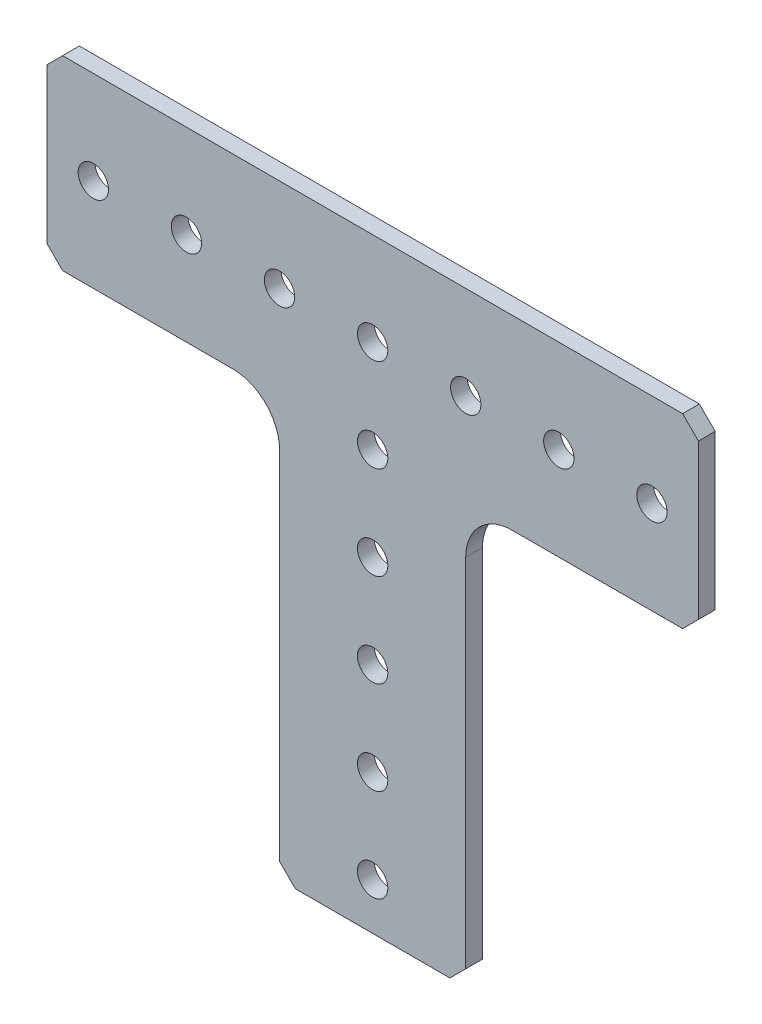
ISO-10303-21;
HEADER;
FILE_DESCRIPTION(('STEP AP214'),'2;1');
FILE_NAME('part.step','',(''),(''),'','','');
FILE_SCHEMA(('AUTOMOTIVE_DESIGN { 1 0 10303 214 1 1 1 1 }'));
ENDSEC;
DATA;
#1=APPLICATION_CONTEXT('core data for automotive mechanical design processes');
#2=APPLICATION_PROTOCOL_DEFINITION('international standard','automotive_design',2000,#1);
#3=PRODUCT_CONTEXT('',#1,'mechanical');
#4=PRODUCT('Part','Part','',(#3));
#5=PRODUCT_RELATED_PRODUCT_CATEGORY('part','',(#4));
#6=PRODUCT_DEFINITION_FORMATION('','',#4);
#7=PRODUCT_DEFINITION_CONTEXT('part definition',#1,'design');
#8=PRODUCT_DEFINITION('design','',#6,#7);
#9=PRODUCT_DEFINITION_SHAPE('','',#8);
#10=(LENGTH_UNIT() NAMED_UNIT(*) SI_UNIT(.MILLI.,.METRE.));
#11=(NAMED_UNIT(*) PLANE_ANGLE_UNIT() SI_UNIT($,.RADIAN.));
#12=(NAMED_UNIT(*) SI_UNIT($,.STERADIAN.) SOLID_ANGLE_UNIT());
#13=UNCERTAINTY_MEASURE_WITH_UNIT(LENGTH_MEASURE(1.E-05),#10,'distance_accuracy_value','');
#14=(GEOMETRIC_REPRESENTATION_CONTEXT(3) GLOBAL_UNCERTAINTY_ASSIGNED_CONTEXT((#13)) GLOBAL_UNIT_ASSIGNED_CONTEXT((#10,
#11,#12)) REPRESENTATION_CONTEXT('',''));
#15=CARTESIAN_POINT('',(0.,0.,0.));
#16=DIRECTION('',(0.,0.,1.));
#17=DIRECTION('',(1.,0.,0.));
#18=AXIS2_PLACEMENT_3D('',#15,#16,#17);
#19=CARTESIAN_POINT('',(10.541,-57.15,0.));
#20=DIRECTION('',(0.707106781186548,-0.707106781186547,0.));
#21=DIRECTION('',(0.707106781186547,0.707106781186548,0.));
#22=AXIS2_PLACEMENT_3D('',#19,#20,#21);
#23=PLANE('',#22);
#24=DIRECTION('',(0.707106781186547,0.707106781186548,0.));
#25=VECTOR('',#24,1.);
#26=CARTESIAN_POINT('',(10.541,-57.15,2.286));
#27=LINE('',#26,#25);
#28=CARTESIAN_POINT('',(10.541,-57.15,2.286));
#29=VERTEX_POINT('',#28);
#30=CARTESIAN_POINT('',(12.7,-54.991,2.286));
#31=VERTEX_POINT('',#30);
#32=EDGE_CURVE('E177',#29,#31,#27,.T.);
#33=ORIENTED_EDGE('',*,*,#32,.F.);
#34=DIRECTION('',(0.,0.,1.));
#35=VECTOR('',#34,1.);
#36=CARTESIAN_POINT('',(10.541,-57.15,0.));
#37=LINE('',#36,#35);
#38=CARTESIAN_POINT('',(10.541,-57.15,0.));
#39=VERTEX_POINT('',#38);
#40=EDGE_CURVE('E11',#39,#29,#37,.T.);
#41=ORIENTED_EDGE('',*,*,#40,.F.);
#42=DIRECTION('',(0.707106781186547,0.707106781186548,0.));
#43=VECTOR('',#42,1.);
#44=CARTESIAN_POINT('',(10.541,-57.15,0.));
#45=LINE('',#44,#43);
#46=CARTESIAN_POINT('',(12.7,-54.991,0.));
#47=VERTEX_POINT('',#46);
#48=EDGE_CURVE('E222',#39,#47,#45,.T.);
#49=ORIENTED_EDGE('',*,*,#48,.T.);
#50=DIRECTION('',(0.,0.,1.));
#51=VECTOR('',#50,1.);
#52=CARTESIAN_POINT('',(12.7,-54.991,0.));
#53=LINE('',#52,#51);
#54=EDGE_CURVE('E35',#47,#31,#53,.T.);
#55=ORIENTED_EDGE('',*,*,#54,.T.);
#56=EDGE_LOOP('',(#33,#41,#49,#55));
#57=FACE_BOUND('',#56,.T.);
#58=ADVANCED_FACE('F32',(#57),#23,.T.);
#59=CARTESIAN_POINT('',(-10.541,-57.15,0.));
#60=DIRECTION('',(0.,-1.,0.));
#61=DIRECTION('',(0.,0.,-1.));
#62=AXIS2_PLACEMENT_3D('',#59,#60,#61);
#63=PLANE('',#62);
#64=DIRECTION('',(1.,0.,0.));
#65=VECTOR('',#64,1.);
#66=CARTESIAN_POINT('',(-10.541,-57.15,2.286));
#67=LINE('',#66,#65);
#68=CARTESIAN_POINT('',(-10.541,-57.15,2.286));
#69=VERTEX_POINT('',#68);
#70=EDGE_CURVE('E220',#69,#29,#67,.T.);
#71=ORIENTED_EDGE('',*,*,#70,.F.);
#72=DIRECTION('',(0.,0.,1.));
#73=VECTOR('',#72,1.);
#74=CARTESIAN_POINT('',(-10.541,-57.15,0.));
#75=LINE('',#74,#73);
#76=CARTESIAN_POINT('',(-10.541,-57.15,0.));
#77=VERTEX_POINT('',#76);
#78=EDGE_CURVE('E41',#77,#69,#75,.T.);
#79=ORIENTED_EDGE('',*,*,#78,.F.);
#80=DIRECTION('',(1.,0.,0.));
#81=VECTOR('',#80,1.);
#82=CARTESIAN_POINT('',(-10.541,-57.15,0.));
#83=LINE('',#82,#81);
#84=EDGE_CURVE('E167',#77,#39,#83,.T.);
#85=ORIENTED_EDGE('',*,*,#84,.T.);
#86=ORIENTED_EDGE('',*,*,#40,.T.);
#87=EDGE_LOOP('',(#71,#79,#85,#86));
#88=FACE_BOUND('',#87,.T.);
#89=ADVANCED_FACE('F250',(#88),#63,.T.);
#90=CARTESIAN_POINT('',(-12.7,-54.991,0.));
#91=DIRECTION('',(-0.707106781186545,-0.70710678118655,0.));
#92=DIRECTION('',(0.70710678118655,-0.707106781186545,0.));
#93=AXIS2_PLACEMENT_3D('',#90,#91,#92);
#94=PLANE('',#93);
#95=DIRECTION('',(0.70710678118655,-0.707106781186545,0.));
#96=VECTOR('',#95,1.);
#97=CARTESIAN_POINT('',(-12.7,-54.991,2.286));
#98=LINE('',#97,#96);
#99=CARTESIAN_POINT('',(-12.7,-54.991,2.286));
#100=VERTEX_POINT('',#99);
#101=EDGE_CURVE('E154',#100,#69,#98,.T.);
#102=ORIENTED_EDGE('',*,*,#101,.F.);
#103=DIRECTION('',(0.,0.,1.));
#104=VECTOR('',#103,1.);
#105=CARTESIAN_POINT('',(-12.7,-54.991,0.));
#106=LINE('',#105,#104);
#107=CARTESIAN_POINT('',(-12.7,-54.991,0.));
#108=VERTEX_POINT('',#107);
#109=EDGE_CURVE('E149',#108,#100,#106,.T.);
#110=ORIENTED_EDGE('',*,*,#109,.F.);
#111=DIRECTION('',(0.70710678118655,-0.707106781186545,0.));
#112=VECTOR('',#111,1.);
#113=CARTESIAN_POINT('',(-12.7,-54.991,0.));
#114=LINE('',#113,#112);
#115=EDGE_CURVE('E152',#108,#77,#114,.T.);
#116=ORIENTED_EDGE('',*,*,#115,.T.);
#117=ORIENTED_EDGE('',*,*,#78,.T.);
#118=EDGE_LOOP('',(#102,#110,#116,#117));
#119=FACE_BOUND('',#118,.T.);
#120=ADVANCED_FACE('F151',(#119),#94,.T.);
#121=CARTESIAN_POINT('',(-12.7,-6.34999999999998,0.));
#122=DIRECTION('',(-1.,0.,0.));
#123=DIRECTION('',(0.,-1.,0.));
#124=AXIS2_PLACEMENT_3D('',#121,#122,#123);
#125=PLANE('',#124);
#126=DIRECTION('',(0.,-1.,0.));
#127=VECTOR('',#126,1.);
#128=CARTESIAN_POINT('',(-12.7,-6.34999999999998,2.286));
#129=LINE('',#128,#127);
#130=CARTESIAN_POINT('',(-12.7,-6.34999999999999,2.286));
#131=VERTEX_POINT('',#130);
#132=EDGE_CURVE('E217',#131,#100,#129,.T.);
#133=ORIENTED_EDGE('',*,*,#132,.F.);
#134=DIRECTION('',(0.,0.,1.));
#135=VECTOR('',#134,1.);
#136=CARTESIAN_POINT('',(-12.7,-6.34999999999999,0.));
#137=LINE('',#136,#135);
#138=CARTESIAN_POINT('',(-12.7,-6.34999999999999,0.));
#139=VERTEX_POINT('',#138);
#140=EDGE_CURVE('E159',#139,#131,#137,.T.);
#141=ORIENTED_EDGE('',*,*,#140,.F.);
#142=DIRECTION('',(0.,-1.,0.));
#143=VECTOR('',#142,1.);
#144=CARTESIAN_POINT('',(-12.7,-6.34999999999998,0.));
#145=LINE('',#144,#143);
#146=EDGE_CURVE('E165',#139,#108,#145,.T.);
#147=ORIENTED_EDGE('',*,*,#146,.T.);
#148=ORIENTED_EDGE('',*,*,#109,.T.);
#149=EDGE_LOOP('',(#133,#141,#147,#148));
#150=FACE_BOUND('',#149,.T.);
#151=ADVANCED_FACE('F169',(#150),#125,.T.);
#152=CARTESIAN_POINT('',(-19.05,-6.34999999999999,0.));
#153=DIRECTION('',(0.,0.,1.));
#154=DIRECTION('',(1.,0.,0.));
#155=AXIS2_PLACEMENT_3D('',#152,#153,#154);
#156=CYLINDRICAL_SURFACE('',#155,6.35);
#157=CARTESIAN_POINT('',(-19.05,-6.34999999999999,2.286));
#158=DIRECTION('',(0.,0.,-1.));
#159=DIRECTION('',(-1.,0.,0.));
#160=AXIS2_PLACEMENT_3D('',#157,#158,#159);
#161=CIRCLE('',#160,6.35);
#162=CARTESIAN_POINT('',(-19.05,0.,2.286));
#163=VERTEX_POINT('',#162);
#164=EDGE_CURVE('E214',#163,#131,#161,.T.);
#165=ORIENTED_EDGE('',*,*,#164,.F.);
#166=DIRECTION('',(0.,0.,1.));
#167=VECTOR('',#166,1.);
#168=CARTESIAN_POINT('',(-19.05,0.,0.));
#169=LINE('',#168,#167);
#170=CARTESIAN_POINT('',(-19.05,0.,0.));
#171=VERTEX_POINT('',#170);
#172=EDGE_CURVE('E226',#171,#163,#169,.T.);
#173=ORIENTED_EDGE('',*,*,#172,.F.);
#174=CARTESIAN_POINT('',(-19.05,-6.34999999999999,0.));
#175=DIRECTION('',(0.,0.,-1.));
#176=DIRECTION('',(-1.,0.,0.));
#177=AXIS2_PLACEMENT_3D('',#174,#175,#176);
#178=CIRCLE('',#177,6.35);
#179=EDGE_CURVE('E170',#171,#139,#178,.T.);
#180=ORIENTED_EDGE('',*,*,#179,.T.);
#181=ORIENTED_EDGE('',*,*,#140,.T.);
#182=EDGE_LOOP('',(#165,#173,#180,#181));
#183=FACE_BOUND('',#182,.T.);
#184=ADVANCED_FACE('F263',(#183),#156,.F.);
#185=CARTESIAN_POINT('',(-42.291,0.,0.));
#186=DIRECTION('',(0.,-1.,0.));
#187=DIRECTION('',(1.,0.,0.));
#188=AXIS2_PLACEMENT_3D('',#185,#186,#187);
#189=PLANE('',#188);
#190=DIRECTION('',(1.,0.,0.));
#191=VECTOR('',#190,1.);
#192=CARTESIAN_POINT('',(-42.291,0.,2.286));
#193=LINE('',#192,#191);
#194=CARTESIAN_POINT('',(-42.291,0.,2.286));
#195=VERTEX_POINT('',#194);
#196=EDGE_CURVE('E211',#195,#163,#193,.T.);
#197=ORIENTED_EDGE('',*,*,#196,.F.);
#198=DIRECTION('',(0.,0.,1.));
#199=VECTOR('',#198,1.);
#200=CARTESIAN_POINT('',(-42.291,0.,0.));
#201=LINE('',#200,#199);
#202=CARTESIAN_POINT('',(-42.291,0.,0.));
#203=VERTEX_POINT('',#202);
#204=EDGE_CURVE('E228',#203,#195,#201,.T.);
#205=ORIENTED_EDGE('',*,*,#204,.F.);
#206=DIRECTION('',(1.,0.,0.));
#207=VECTOR('',#206,1.);
#208=CARTESIAN_POINT('',(-42.291,0.,0.));
#209=LINE('',#208,#207);
#210=EDGE_CURVE('E172',#203,#171,#209,.T.);
#211=ORIENTED_EDGE('',*,*,#210,.T.);
#212=ORIENTED_EDGE('',*,*,#172,.T.);
#213=EDGE_LOOP('',(#197,#205,#211,#212));
#214=FACE_BOUND('',#213,.T.);
#215=ADVANCED_FACE('F266',(#214),#189,.T.);
#216=CARTESIAN_POINT('',(-44.45,2.15899999999999,0.));
#217=DIRECTION('',(-0.707106781186545,-0.70710678118655,0.));
#218=DIRECTION('',(0.70710678118655,-0.707106781186545,0.));
#219=AXIS2_PLACEMENT_3D('',#216,#217,#218);
#220=PLANE('',#219);
#221=DIRECTION('',(0.70710678118655,-0.707106781186545,0.));
#222=VECTOR('',#221,1.);
#223=CARTESIAN_POINT('',(-44.45,2.15899999999999,2.286));
#224=LINE('',#223,#222);
#225=CARTESIAN_POINT('',(-44.45,2.15899999999999,2.286));
#226=VERTEX_POINT('',#225);
#227=EDGE_CURVE('E208',#226,#195,#224,.T.);
#228=ORIENTED_EDGE('',*,*,#227,.F.);
#229=DIRECTION('',(0.,0.,1.));
#230=VECTOR('',#229,1.);
#231=CARTESIAN_POINT('',(-44.45,2.15899999999999,0.));
#232=LINE('',#231,#230);
#233=CARTESIAN_POINT('',(-44.45,2.15899999999999,0.));
#234=VERTEX_POINT('',#233);
#235=EDGE_CURVE('E230',#234,#226,#232,.T.);
#236=ORIENTED_EDGE('',*,*,#235,.F.);
#237=DIRECTION('',(0.70710678118655,-0.707106781186545,0.));
#238=VECTOR('',#237,1.);
#239=CARTESIAN_POINT('',(-44.45,2.15899999999999,0.));
#240=LINE('',#239,#238);
#241=EDGE_CURVE('E468',#234,#203,#240,.T.);
#242=ORIENTED_EDGE('',*,*,#241,.T.);
#243=ORIENTED_EDGE('',*,*,#204,.T.);
#244=EDGE_LOOP('',(#228,#236,#242,#243));
#245=FACE_BOUND('',#244,.T.);
#246=ADVANCED_FACE('F270',(#245),#220,.T.);
#247=CARTESIAN_POINT('',(-44.45,23.241,0.));
#248=DIRECTION('',(-1.,0.,0.));
#249=DIRECTION('',(0.,-1.,0.));
#250=AXIS2_PLACEMENT_3D('',#247,#248,#249);
#251=PLANE('',#250);
#252=DIRECTION('',(0.,-1.,0.));
#253=VECTOR('',#252,1.);
#254=CARTESIAN_POINT('',(-44.45,23.241,2.286));
#255=LINE('',#254,#253);
#256=CARTESIAN_POINT('',(-44.45,23.241,2.286));
#257=VERTEX_POINT('',#256);
#258=EDGE_CURVE('E205',#257,#226,#255,.T.);
#259=ORIENTED_EDGE('',*,*,#258,.F.);
#260=DIRECTION('',(0.,0.,1.));
#261=VECTOR('',#260,1.);
#262=CARTESIAN_POINT('',(-44.45,23.241,0.));
#263=LINE('',#262,#261);
#264=CARTESIAN_POINT('',(-44.45,23.241,0.));
#265=VERTEX_POINT('',#264);
#266=EDGE_CURVE('E232',#265,#257,#263,.T.);
#267=ORIENTED_EDGE('',*,*,#266,.F.);
#268=DIRECTION('',(0.,-1.,0.));
#269=VECTOR('',#268,1.);
#270=CARTESIAN_POINT('',(-44.45,23.241,0.));
#271=LINE('',#270,#269);
#272=EDGE_CURVE('E465',#265,#234,#271,.T.);
#273=ORIENTED_EDGE('',*,*,#272,.T.);
#274=ORIENTED_EDGE('',*,*,#235,.T.);
#275=EDGE_LOOP('',(#259,#267,#273,#274));
#276=FACE_BOUND('',#275,.T.);
#277=ADVANCED_FACE('F274',(#276),#251,.T.);
#278=CARTESIAN_POINT('',(-42.291,25.4,0.));
#279=DIRECTION('',(-0.707106781186543,0.707106781186552,0.));
#280=DIRECTION('',(-0.707106781186552,-0.707106781186543,0.));
#281=AXIS2_PLACEMENT_3D('',#278,#279,#280);
#282=PLANE('',#281);
#283=DIRECTION('',(-0.707106781186552,-0.707106781186543,0.));
#284=VECTOR('',#283,1.);
#285=CARTESIAN_POINT('',(-42.291,25.4,2.286));
#286=LINE('',#285,#284);
#287=CARTESIAN_POINT('',(-42.291,25.4,2.286));
#288=VERTEX_POINT('',#287);
#289=EDGE_CURVE('E202',#288,#257,#286,.T.);
#290=ORIENTED_EDGE('',*,*,#289,.F.);
#291=DIRECTION('',(0.,0.,1.));
#292=VECTOR('',#291,1.);
#293=CARTESIAN_POINT('',(-42.291,25.4,0.));
#294=LINE('',#293,#292);
#295=CARTESIAN_POINT('',(-42.291,25.4,0.));
#296=VERTEX_POINT('',#295);
#297=EDGE_CURVE('E234',#296,#288,#294,.T.);
#298=ORIENTED_EDGE('',*,*,#297,.F.);
#299=DIRECTION('',(-0.707106781186552,-0.707106781186543,0.));
#300=VECTOR('',#299,1.);
#301=CARTESIAN_POINT('',(-42.291,25.4,0.));
#302=LINE('',#301,#300);
#303=EDGE_CURVE('E462',#296,#265,#302,.T.);
#304=ORIENTED_EDGE('',*,*,#303,.T.);
#305=ORIENTED_EDGE('',*,*,#266,.T.);
#306=EDGE_LOOP('',(#290,#298,#304,#305));
#307=FACE_BOUND('',#306,.T.);
#308=ADVANCED_FACE('F278',(#307),#282,.T.);
#309=CARTESIAN_POINT('',(42.291,25.4,0.));
#310=DIRECTION('',(0.,1.,0.));
#311=DIRECTION('',(-1.,0.,0.));
#312=AXIS2_PLACEMENT_3D('',#309,#310,#311);
#313=PLANE('',#312);
#314=DIRECTION('',(-1.,0.,0.));
#315=VECTOR('',#314,1.);
#316=CARTESIAN_POINT('',(42.291,25.4,2.286));
#317=LINE('',#316,#315);
#318=CARTESIAN_POINT('',(42.291,25.4,2.286));
#319=VERTEX_POINT('',#318);
#320=EDGE_CURVE('E199',#319,#288,#317,.T.);
#321=ORIENTED_EDGE('',*,*,#320,.F.);
#322=DIRECTION('',(0.,0.,1.));
#323=VECTOR('',#322,1.);
#324=CARTESIAN_POINT('',(42.291,25.4,0.));
#325=LINE('',#324,#323);
#326=CARTESIAN_POINT('',(42.291,25.4,0.));
#327=VERTEX_POINT('',#326);
#328=EDGE_CURVE('E236',#327,#319,#325,.T.);
#329=ORIENTED_EDGE('',*,*,#328,.F.);
#330=DIRECTION('',(-1.,0.,0.));
#331=VECTOR('',#330,1.);
#332=CARTESIAN_POINT('',(42.291,25.4,0.));
#333=LINE('',#332,#331);
#334=EDGE_CURVE('E459',#327,#296,#333,.T.);
#335=ORIENTED_EDGE('',*,*,#334,.T.);
#336=ORIENTED_EDGE('',*,*,#297,.T.);
#337=EDGE_LOOP('',(#321,#329,#335,#336));
#338=FACE_BOUND('',#337,.T.);
#339=ADVANCED_FACE('F282',(#338),#313,.T.);
#340=CARTESIAN_POINT('',(44.45,23.241,0.));
#341=DIRECTION('',(0.707106781186546,0.707106781186549,0.));
#342=DIRECTION('',(-0.707106781186549,0.707106781186546,0.));
#343=AXIS2_PLACEMENT_3D('',#340,#341,#342);
#344=PLANE('',#343);
#345=DIRECTION('',(-0.707106781186549,0.707106781186546,0.));
#346=VECTOR('',#345,1.);
#347=CARTESIAN_POINT('',(44.45,23.241,2.286));
#348=LINE('',#347,#346);
#349=CARTESIAN_POINT('',(44.45,23.241,2.286));
#350=VERTEX_POINT('',#349);
#351=EDGE_CURVE('E196',#350,#319,#348,.T.);
#352=ORIENTED_EDGE('',*,*,#351,.F.);
#353=DIRECTION('',(0.,0.,1.));
#354=VECTOR('',#353,1.);
#355=CARTESIAN_POINT('',(44.45,23.241,0.));
#356=LINE('',#355,#354);
#357=CARTESIAN_POINT('',(44.45,23.241,0.));
#358=VERTEX_POINT('',#357);
#359=EDGE_CURVE('E238',#358,#350,#356,.T.);
#360=ORIENTED_EDGE('',*,*,#359,.F.);
#361=DIRECTION('',(-0.707106781186549,0.707106781186546,0.));
#362=VECTOR('',#361,1.);
#363=CARTESIAN_POINT('',(44.45,23.241,0.));
#364=LINE('',#363,#362);
#365=EDGE_CURVE('E456',#358,#327,#364,.T.);
#366=ORIENTED_EDGE('',*,*,#365,.T.);
#367=ORIENTED_EDGE('',*,*,#328,.T.);
#368=EDGE_LOOP('',(#352,#360,#366,#367));
#369=FACE_BOUND('',#368,.T.);
#370=ADVANCED_FACE('F286',(#369),#344,.T.);
#371=CARTESIAN_POINT('',(44.45,2.15900000000002,0.));
#372=DIRECTION('',(1.,0.,0.));
#373=DIRECTION('',(0.,1.,0.));
#374=AXIS2_PLACEMENT_3D('',#371,#372,#373);
#375=PLANE('',#374);
#376=DIRECTION('',(0.,1.,0.));
#377=VECTOR('',#376,1.);
#378=CARTESIAN_POINT('',(44.45,2.15900000000002,2.286));
#379=LINE('',#378,#377);
#380=CARTESIAN_POINT('',(44.45,2.15900000000002,2.286));
#381=VERTEX_POINT('',#380);
#382=EDGE_CURVE('E193',#381,#350,#379,.T.);
#383=ORIENTED_EDGE('',*,*,#382,.F.);
#384=DIRECTION('',(0.,0.,1.));
#385=VECTOR('',#384,1.);
#386=CARTESIAN_POINT('',(44.45,2.15900000000002,0.));
#387=LINE('',#386,#385);
#388=CARTESIAN_POINT('',(44.45,2.15900000000002,0.));
#389=VERTEX_POINT('',#388);
#390=EDGE_CURVE('E240',#389,#381,#387,.T.);
#391=ORIENTED_EDGE('',*,*,#390,.F.);
#392=DIRECTION('',(0.,1.,0.));
#393=VECTOR('',#392,1.);
#394=CARTESIAN_POINT('',(44.45,2.15900000000002,0.));
#395=LINE('',#394,#393);
#396=EDGE_CURVE('E453',#389,#358,#395,.T.);
#397=ORIENTED_EDGE('',*,*,#396,.T.);
#398=ORIENTED_EDGE('',*,*,#359,.T.);
#399=EDGE_LOOP('',(#383,#391,#397,#398));
#400=FACE_BOUND('',#399,.T.);
#401=ADVANCED_FACE('F290',(#400),#375,.T.);
#402=CARTESIAN_POINT('',(42.291,0.,0.));
#403=DIRECTION('',(0.707106781186549,-0.707106781186547,0.));
#404=DIRECTION('',(0.707106781186547,0.707106781186549,0.));
#405=AXIS2_PLACEMENT_3D('',#402,#403,#404);
#406=PLANE('',#405);
#407=DIRECTION('',(0.707106781186546,0.707106781186548,0.));
#408=VECTOR('',#407,1.);
#409=CARTESIAN_POINT('',(42.291,0.,2.286));
#410=LINE('',#409,#408);
#411=CARTESIAN_POINT('',(42.291,0.,2.286));
#412=VERTEX_POINT('',#411);
#413=EDGE_CURVE('E190',#412,#381,#410,.T.);
#414=ORIENTED_EDGE('',*,*,#413,.F.);
#415=DIRECTION('',(0.,0.,1.));
#416=VECTOR('',#415,1.);
#417=CARTESIAN_POINT('',(42.291,0.,0.));
#418=LINE('',#417,#416);
#419=CARTESIAN_POINT('',(42.291,0.,0.));
#420=VERTEX_POINT('',#419);
#421=EDGE_CURVE('E242',#420,#412,#418,.T.);
#422=ORIENTED_EDGE('',*,*,#421,.F.);
#423=DIRECTION('',(0.707106781186546,0.707106781186548,0.));
#424=VECTOR('',#423,1.);
#425=CARTESIAN_POINT('',(42.291,0.,0.));
#426=LINE('',#425,#424);
#427=EDGE_CURVE('E450',#420,#389,#426,.T.);
#428=ORIENTED_EDGE('',*,*,#427,.T.);
#429=ORIENTED_EDGE('',*,*,#390,.T.);
#430=EDGE_LOOP('',(#414,#422,#428,#429));
#431=FACE_BOUND('',#430,.T.);
#432=ADVANCED_FACE('F294',(#431),#406,.T.);
#433=CARTESIAN_POINT('',(19.05,0.,0.));
#434=DIRECTION('',(0.,-1.,0.));
#435=DIRECTION('',(1.,0.,0.));
#436=AXIS2_PLACEMENT_3D('',#433,#434,#435);
#437=PLANE('',#436);
#438=DIRECTION('',(1.,0.,0.));
#439=VECTOR('',#438,1.);
#440=CARTESIAN_POINT('',(19.05,0.,2.286));
#441=LINE('',#440,#439);
#442=CARTESIAN_POINT('',(19.05,0.,2.286));
#443=VERTEX_POINT('',#442);
#444=EDGE_CURVE('E187',#443,#412,#441,.T.);
#445=ORIENTED_EDGE('',*,*,#444,.F.);
#446=DIRECTION('',(0.,0.,1.));
#447=VECTOR('',#446,1.);
#448=CARTESIAN_POINT('',(19.05,0.,0.));
#449=LINE('',#448,#447);
#450=CARTESIAN_POINT('',(19.05,0.,0.));
#451=VERTEX_POINT('',#450);
#452=EDGE_CURVE('E244',#451,#443,#449,.T.);
#453=ORIENTED_EDGE('',*,*,#452,.F.);
#454=DIRECTION('',(1.,0.,0.));
#455=VECTOR('',#454,1.);
#456=CARTESIAN_POINT('',(19.05,0.,0.));
#457=LINE('',#456,#455);
#458=EDGE_CURVE('E447',#451,#420,#457,.T.);
#459=ORIENTED_EDGE('',*,*,#458,.T.);
#460=ORIENTED_EDGE('',*,*,#421,.T.);
#461=EDGE_LOOP('',(#445,#453,#459,#460));
#462=FACE_BOUND('',#461,.T.);
#463=ADVANCED_FACE('F298',(#462),#437,.T.);
#464=CARTESIAN_POINT('',(19.05,-6.34999999999998,0.));
#465=DIRECTION('',(0.,0.,1.));
#466=DIRECTION('',(1.,0.,0.));
#467=AXIS2_PLACEMENT_3D('',#464,#465,#466);
#468=CYLINDRICAL_SURFACE('',#467,6.35);
#469=CARTESIAN_POINT('',(19.05,-6.34999999999998,2.286));
#470=DIRECTION('',(0.,0.,-1.));
#471=DIRECTION('',(-1.,0.,0.));
#472=AXIS2_PLACEMENT_3D('',#469,#470,#471);
#473=CIRCLE('',#472,6.35);
#474=CARTESIAN_POINT('',(12.7,-6.34999999999998,2.286));
#475=VERTEX_POINT('',#474);
#476=EDGE_CURVE('E184',#475,#443,#473,.T.);
#477=ORIENTED_EDGE('',*,*,#476,.F.);
#478=DIRECTION('',(0.,0.,1.));
#479=VECTOR('',#478,1.);
#480=CARTESIAN_POINT('',(12.7,-6.34999999999998,0.));
#481=LINE('',#480,#479);
#482=CARTESIAN_POINT('',(12.7,-6.34999999999998,0.));
#483=VERTEX_POINT('',#482);
#484=EDGE_CURVE('E245',#483,#475,#481,.T.);
#485=ORIENTED_EDGE('',*,*,#484,.F.);
#486=CARTESIAN_POINT('',(19.05,-6.34999999999998,0.));
#487=DIRECTION('',(0.,0.,-1.));
#488=DIRECTION('',(-1.,0.,0.));
#489=AXIS2_PLACEMENT_3D('',#486,#487,#488);
#490=CIRCLE('',#489,6.35);
#491=EDGE_CURVE('E444',#483,#451,#490,.T.);
#492=ORIENTED_EDGE('',*,*,#491,.T.);
#493=ORIENTED_EDGE('',*,*,#452,.T.);
#494=EDGE_LOOP('',(#477,#485,#492,#493));
#495=FACE_BOUND('',#494,.T.);
#496=ADVANCED_FACE('F302',(#495),#468,.F.);
#497=CARTESIAN_POINT('',(12.7,-54.991,0.));
#498=DIRECTION('',(1.,0.,0.));
#499=DIRECTION('',(0.,1.,0.));
#500=AXIS2_PLACEMENT_3D('',#497,#498,#499);
#501=PLANE('',#500);
#502=DIRECTION('',(0.,1.,0.));
#503=VECTOR('',#502,1.);
#504=CARTESIAN_POINT('',(12.7,-54.991,2.286));
#505=LINE('',#504,#503);
#506=EDGE_CURVE('E180',#31,#475,#505,.T.);
#507=ORIENTED_EDGE('',*,*,#506,.F.);
#508=ORIENTED_EDGE('',*,*,#54,.F.);
#509=DIRECTION('',(0.,1.,0.));
#510=VECTOR('',#509,1.);
#511=CARTESIAN_POINT('',(12.7,-54.991,0.));
#512=LINE('',#511,#510);
#513=EDGE_CURVE('E442',#47,#483,#512,.T.);
#514=ORIENTED_EDGE('',*,*,#513,.T.);
#515=ORIENTED_EDGE('',*,*,#484,.T.);
#516=EDGE_LOOP('',(#507,#508,#514,#515));
#517=FACE_BOUND('',#516,.T.);
#518=ADVANCED_FACE('F247',(#517),#501,.T.);
#519=CARTESIAN_POINT('',(19.05,-6.34999999999998,0.));
#520=DIRECTION('',(0.,0.,-1.));
#521=DIRECTION('',(-1.,0.,0.));
#522=AXIS2_PLACEMENT_3D('',#519,#520,#521);
#523=PLANE('',#522);
#524=CARTESIAN_POINT('',(0.,-50.8,0.));
#525=DIRECTION('',(0.,0.,1.));
#526=DIRECTION('',(-1.,0.,0.));
#527=AXIS2_PLACEMENT_3D('',#524,#525,#526);
#528=CIRCLE('',#527,2.0701);
#529=CARTESIAN_POINT('',(-2.07009999999999,-50.8,0.));
#530=VERTEX_POINT('',#529);
#531=EDGE_CURVE('E369',#530,#530,#528,.T.);
#532=ORIENTED_EDGE('',*,*,#531,.T.);
#533=EDGE_LOOP('',(#532));
#534=FACE_BOUND('',#533,.T.);
#535=CARTESIAN_POINT('',(0.,-25.4,0.));
#536=DIRECTION('',(0.,0.,1.));
#537=DIRECTION('',(-1.,0.,0.));
#538=AXIS2_PLACEMENT_3D('',#535,#536,#537);
#539=CIRCLE('',#538,2.0701);
#540=CARTESIAN_POINT('',(-2.0701,-25.4,0.));
#541=VERTEX_POINT('',#540);
#542=EDGE_CURVE('E377',#541,#541,#539,.T.);
#543=ORIENTED_EDGE('',*,*,#542,.T.);
#544=EDGE_LOOP('',(#543));
#545=FACE_BOUND('',#544,.T.);
#546=CARTESIAN_POINT('',(0.,0.,0.));
#547=DIRECTION('',(0.,0.,1.));
#548=DIRECTION('',(-1.,0.,0.));
#549=AXIS2_PLACEMENT_3D('',#546,#547,#548);
#550=CIRCLE('',#549,2.0701);
#551=CARTESIAN_POINT('',(-2.0701,0.,0.));
#552=VERTEX_POINT('',#551);
#553=EDGE_CURVE('E383',#552,#552,#550,.T.);
#554=ORIENTED_EDGE('',*,*,#553,.T.);
#555=EDGE_LOOP('',(#554));
#556=FACE_BOUND('',#555,.T.);
#557=CARTESIAN_POINT('',(25.4,12.7,0.));
#558=DIRECTION('',(0.,0.,1.));
#559=DIRECTION('',(-1.,0.,0.));
#560=AXIS2_PLACEMENT_3D('',#557,#558,#559);
#561=CIRCLE('',#560,2.0701);
#562=CARTESIAN_POINT('',(23.3299,12.7,0.));
#563=VERTEX_POINT('',#562);
#564=EDGE_CURVE('E389',#563,#563,#561,.T.);
#565=ORIENTED_EDGE('',*,*,#564,.T.);
#566=EDGE_LOOP('',(#565));
#567=FACE_BOUND('',#566,.T.);
#568=CARTESIAN_POINT('',(0.,12.7,0.));
#569=DIRECTION('',(0.,0.,1.));
#570=DIRECTION('',(-1.,0.,0.));
#571=AXIS2_PLACEMENT_3D('',#568,#569,#570);
#572=CIRCLE('',#571,2.0701);
#573=CARTESIAN_POINT('',(-2.0701,12.7,0.));
#574=VERTEX_POINT('',#573);
#575=EDGE_CURVE('E395',#574,#574,#572,.T.);
#576=ORIENTED_EDGE('',*,*,#575,.T.);
#577=EDGE_LOOP('',(#576));
#578=FACE_BOUND('',#577,.T.);
#579=CARTESIAN_POINT('',(-25.4,12.7,0.));
#580=DIRECTION('',(0.,0.,1.));
#581=DIRECTION('',(-1.,0.,0.));
#582=AXIS2_PLACEMENT_3D('',#579,#580,#581);
#583=CIRCLE('',#582,2.0701);
#584=CARTESIAN_POINT('',(-27.4701,12.7,0.));
#585=VERTEX_POINT('',#584);
#586=EDGE_CURVE('E401',#585,#585,#583,.T.);
#587=ORIENTED_EDGE('',*,*,#586,.T.);
#588=EDGE_LOOP('',(#587));
#589=FACE_BOUND('',#588,.T.);
#590=CARTESIAN_POINT('',(-38.1,12.7,0.));
#591=DIRECTION('',(0.,0.,1.));
#592=DIRECTION('',(-1.,0.,0.));
#593=AXIS2_PLACEMENT_3D('',#590,#591,#592);
#594=CIRCLE('',#593,2.0701);
#595=CARTESIAN_POINT('',(-40.1701,12.7,0.));
#596=VERTEX_POINT('',#595);
#597=EDGE_CURVE('E407',#596,#596,#594,.T.);
#598=ORIENTED_EDGE('',*,*,#597,.T.);
#599=EDGE_LOOP('',(#598));
#600=FACE_BOUND('',#599,.T.);
#601=CARTESIAN_POINT('',(-12.7,12.7,0.));
#602=DIRECTION('',(0.,0.,1.));
#603=DIRECTION('',(-1.,0.,0.));
#604=AXIS2_PLACEMENT_3D('',#601,#602,#603);
#605=CIRCLE('',#604,2.0701);
#606=CARTESIAN_POINT('',(-14.7701,12.7,0.));
#607=VERTEX_POINT('',#606);
#608=EDGE_CURVE('E413',#607,#607,#605,.T.);
#609=ORIENTED_EDGE('',*,*,#608,.T.);
#610=EDGE_LOOP('',(#609));
#611=FACE_BOUND('',#610,.T.);
#612=CARTESIAN_POINT('',(12.7,12.7,0.));
#613=DIRECTION('',(0.,0.,1.));
#614=DIRECTION('',(-1.,0.,0.));
#615=AXIS2_PLACEMENT_3D('',#612,#613,#614);
#616=CIRCLE('',#615,2.0701);
#617=CARTESIAN_POINT('',(10.6299,12.7,0.));
#618=VERTEX_POINT('',#617);
#619=EDGE_CURVE('E419',#618,#618,#616,.T.);
#620=ORIENTED_EDGE('',*,*,#619,.T.);
#621=EDGE_LOOP('',(#620));
#622=FACE_BOUND('',#621,.T.);
#623=CARTESIAN_POINT('',(38.1,12.7,0.));
#624=DIRECTION('',(0.,0.,1.));
#625=DIRECTION('',(-1.,0.,0.));
#626=AXIS2_PLACEMENT_3D('',#623,#624,#625);
#627=CIRCLE('',#626,2.0701);
#628=CARTESIAN_POINT('',(36.0299,12.7,0.));
#629=VERTEX_POINT('',#628);
#630=EDGE_CURVE('E425',#629,#629,#627,.T.);
#631=ORIENTED_EDGE('',*,*,#630,.T.);
#632=EDGE_LOOP('',(#631));
#633=FACE_BOUND('',#632,.T.);
#634=CARTESIAN_POINT('',(0.,-12.7,0.));
#635=DIRECTION('',(0.,0.,1.));
#636=DIRECTION('',(-1.,0.,0.));
#637=AXIS2_PLACEMENT_3D('',#634,#635,#636);
#638=CIRCLE('',#637,2.0701);
#639=CARTESIAN_POINT('',(-2.0701,-12.7,0.));
#640=VERTEX_POINT('',#639);
#641=EDGE_CURVE('E431',#640,#640,#638,.T.);
#642=ORIENTED_EDGE('',*,*,#641,.T.);
#643=EDGE_LOOP('',(#642));
#644=FACE_BOUND('',#643,.T.);
#645=CARTESIAN_POINT('',(0.,-38.1,0.));
#646=DIRECTION('',(0.,0.,1.));
#647=DIRECTION('',(-1.,0.,0.));
#648=AXIS2_PLACEMENT_3D('',#645,#646,#647);
#649=CIRCLE('',#648,2.0701);
#650=CARTESIAN_POINT('',(-2.0701,-38.1,0.));
#651=VERTEX_POINT('',#650);
#652=EDGE_CURVE('E181',#651,#651,#649,.T.);
#653=ORIENTED_EDGE('',*,*,#652,.T.);
#654=EDGE_LOOP('',(#653));
#655=FACE_BOUND('',#654,.T.);
#656=ORIENTED_EDGE('',*,*,#48,.F.);
#657=ORIENTED_EDGE('',*,*,#84,.F.);
#658=ORIENTED_EDGE('',*,*,#115,.F.);
#659=ORIENTED_EDGE('',*,*,#146,.F.);
#660=ORIENTED_EDGE('',*,*,#179,.F.);
#661=ORIENTED_EDGE('',*,*,#210,.F.);
#662=ORIENTED_EDGE('',*,*,#241,.F.);
#663=ORIENTED_EDGE('',*,*,#272,.F.);
#664=ORIENTED_EDGE('',*,*,#303,.F.);
#665=ORIENTED_EDGE('',*,*,#334,.F.);
#666=ORIENTED_EDGE('',*,*,#365,.F.);
#667=ORIENTED_EDGE('',*,*,#396,.F.);
#668=ORIENTED_EDGE('',*,*,#427,.F.);
#669=ORIENTED_EDGE('',*,*,#458,.F.);
#670=ORIENTED_EDGE('',*,*,#491,.F.);
#671=ORIENTED_EDGE('',*,*,#513,.F.);
#672=EDGE_LOOP('',(#656,#657,#658,#659,#660,#661,#662,#663,#664,#665,#666,#667,#668,#669,#670,#671));
#673=FACE_BOUND('',#672,.T.);
#674=ADVANCED_FACE('F163',(#534,#545,#556,#567,#578,#589,#600,#611,#622,#633,#644,#655,#673),
#523,.T.);
#675=CARTESIAN_POINT('',(19.05,-6.34999999999998,2.286));
#676=DIRECTION('',(0.,0.,-1.));
#677=DIRECTION('',(-1.,0.,0.));
#678=AXIS2_PLACEMENT_3D('',#675,#676,#677);
#679=PLANE('',#678);
#680=CARTESIAN_POINT('',(0.,-50.8,2.286));
#681=DIRECTION('',(0.,0.,1.));
#682=DIRECTION('',(-1.,0.,0.));
#683=AXIS2_PLACEMENT_3D('',#680,#681,#682);
#684=CIRCLE('',#683,2.0701);
#685=CARTESIAN_POINT('',(-2.07009999999999,-50.8,2.286));
#686=VERTEX_POINT('',#685);
#687=EDGE_CURVE('E372',#686,#686,#684,.T.);
#688=ORIENTED_EDGE('',*,*,#687,.F.);
#689=EDGE_LOOP('',(#688));
#690=FACE_BOUND('',#689,.T.);
#691=CARTESIAN_POINT('',(0.,-25.4,2.286));
#692=DIRECTION('',(0.,0.,1.));
#693=DIRECTION('',(-1.,0.,0.));
#694=AXIS2_PLACEMENT_3D('',#691,#692,#693);
#695=CIRCLE('',#694,2.0701);
#696=CARTESIAN_POINT('',(-2.0701,-25.4,2.286));
#697=VERTEX_POINT('',#696);
#698=EDGE_CURVE('E374',#697,#697,#695,.T.);
#699=ORIENTED_EDGE('',*,*,#698,.F.);
#700=EDGE_LOOP('',(#699));
#701=FACE_BOUND('',#700,.T.);
#702=CARTESIAN_POINT('',(0.,0.,2.286));
#703=DIRECTION('',(0.,0.,1.));
#704=DIRECTION('',(-1.,0.,0.));
#705=AXIS2_PLACEMENT_3D('',#702,#703,#704);
#706=CIRCLE('',#705,2.0701);
#707=CARTESIAN_POINT('',(-2.0701,0.,2.286));
#708=VERTEX_POINT('',#707);
#709=EDGE_CURVE('E380',#708,#708,#706,.T.);
#710=ORIENTED_EDGE('',*,*,#709,.F.);
#711=EDGE_LOOP('',(#710));
#712=FACE_BOUND('',#711,.T.);
#713=CARTESIAN_POINT('',(25.4,12.7,2.286));
#714=DIRECTION('',(0.,0.,1.));
#715=DIRECTION('',(-1.,0.,0.));
#716=AXIS2_PLACEMENT_3D('',#713,#714,#715);
#717=CIRCLE('',#716,2.0701);
#718=CARTESIAN_POINT('',(23.3299,12.7,2.286));
#719=VERTEX_POINT('',#718);
#720=EDGE_CURVE('E386',#719,#719,#717,.T.);
#721=ORIENTED_EDGE('',*,*,#720,.F.);
#722=EDGE_LOOP('',(#721));
#723=FACE_BOUND('',#722,.T.);
#724=CARTESIAN_POINT('',(0.,12.7,2.286));
#725=DIRECTION('',(0.,0.,1.));
#726=DIRECTION('',(-1.,0.,0.));
#727=AXIS2_PLACEMENT_3D('',#724,#725,#726);
#728=CIRCLE('',#727,2.0701);
#729=CARTESIAN_POINT('',(-2.0701,12.7,2.286));
#730=VERTEX_POINT('',#729);
#731=EDGE_CURVE('E392',#730,#730,#728,.T.);
#732=ORIENTED_EDGE('',*,*,#731,.F.);
#733=EDGE_LOOP('',(#732));
#734=FACE_BOUND('',#733,.T.);
#735=CARTESIAN_POINT('',(-25.4,12.7,2.286));
#736=DIRECTION('',(0.,0.,1.));
#737=DIRECTION('',(-1.,0.,0.));
#738=AXIS2_PLACEMENT_3D('',#735,#736,#737);
#739=CIRCLE('',#738,2.0701);
#740=CARTESIAN_POINT('',(-27.4701,12.7,2.286));
#741=VERTEX_POINT('',#740);
#742=EDGE_CURVE('E398',#741,#741,#739,.T.);
#743=ORIENTED_EDGE('',*,*,#742,.F.);
#744=EDGE_LOOP('',(#743));
#745=FACE_BOUND('',#744,.T.);
#746=CARTESIAN_POINT('',(-38.1,12.7,2.286));
#747=DIRECTION('',(0.,0.,1.));
#748=DIRECTION('',(-1.,0.,0.));
#749=AXIS2_PLACEMENT_3D('',#746,#747,#748);
#750=CIRCLE('',#749,2.0701);
#751=CARTESIAN_POINT('',(-40.1701,12.7,2.286));
#752=VERTEX_POINT('',#751);
#753=EDGE_CURVE('E404',#752,#752,#750,.T.);
#754=ORIENTED_EDGE('',*,*,#753,.F.);
#755=EDGE_LOOP('',(#754));
#756=FACE_BOUND('',#755,.T.);
#757=CARTESIAN_POINT('',(-12.7,12.7,2.286));
#758=DIRECTION('',(0.,0.,1.));
#759=DIRECTION('',(-1.,0.,0.));
#760=AXIS2_PLACEMENT_3D('',#757,#758,#759);
#761=CIRCLE('',#760,2.0701);
#762=CARTESIAN_POINT('',(-14.7701,12.7,2.286));
#763=VERTEX_POINT('',#762);
#764=EDGE_CURVE('E410',#763,#763,#761,.T.);
#765=ORIENTED_EDGE('',*,*,#764,.F.);
#766=EDGE_LOOP('',(#765));
#767=FACE_BOUND('',#766,.T.);
#768=CARTESIAN_POINT('',(12.7,12.7,2.286));
#769=DIRECTION('',(0.,0.,1.));
#770=DIRECTION('',(-1.,0.,0.));
#771=AXIS2_PLACEMENT_3D('',#768,#769,#770);
#772=CIRCLE('',#771,2.0701);
#773=CARTESIAN_POINT('',(10.6299,12.7,2.286));
#774=VERTEX_POINT('',#773);
#775=EDGE_CURVE('E416',#774,#774,#772,.T.);
#776=ORIENTED_EDGE('',*,*,#775,.F.);
#777=EDGE_LOOP('',(#776));
#778=FACE_BOUND('',#777,.T.);
#779=CARTESIAN_POINT('',(38.1,12.7,2.286));
#780=DIRECTION('',(0.,0.,1.));
#781=DIRECTION('',(-1.,0.,0.));
#782=AXIS2_PLACEMENT_3D('',#779,#780,#781);
#783=CIRCLE('',#782,2.0701);
#784=CARTESIAN_POINT('',(36.0299,12.7,2.286));
#785=VERTEX_POINT('',#784);
#786=EDGE_CURVE('E422',#785,#785,#783,.T.);
#787=ORIENTED_EDGE('',*,*,#786,.F.);
#788=EDGE_LOOP('',(#787));
#789=FACE_BOUND('',#788,.T.);
#790=CARTESIAN_POINT('',(0.,-12.7,2.286));
#791=DIRECTION('',(0.,0.,1.));
#792=DIRECTION('',(-1.,0.,0.));
#793=AXIS2_PLACEMENT_3D('',#790,#791,#792);
#794=CIRCLE('',#793,2.0701);
#795=CARTESIAN_POINT('',(-2.0701,-12.7,2.286));
#796=VERTEX_POINT('',#795);
#797=EDGE_CURVE('E428',#796,#796,#794,.T.);
#798=ORIENTED_EDGE('',*,*,#797,.F.);
#799=EDGE_LOOP('',(#798));
#800=FACE_BOUND('',#799,.T.);
#801=CARTESIAN_POINT('',(0.,-38.1,2.286));
#802=DIRECTION('',(0.,0.,1.));
#803=DIRECTION('',(-1.,0.,0.));
#804=AXIS2_PLACEMENT_3D('',#801,#802,#803);
#805=CIRCLE('',#804,2.0701);
#806=CARTESIAN_POINT('',(-2.0701,-38.1,2.286));
#807=VERTEX_POINT('',#806);
#808=EDGE_CURVE('E434',#807,#807,#805,.T.);
#809=ORIENTED_EDGE('',*,*,#808,.F.);
#810=EDGE_LOOP('',(#809));
#811=FACE_BOUND('',#810,.T.);
#812=ORIENTED_EDGE('',*,*,#32,.T.);
#813=ORIENTED_EDGE('',*,*,#506,.T.);
#814=ORIENTED_EDGE('',*,*,#476,.T.);
#815=ORIENTED_EDGE('',*,*,#444,.T.);
#816=ORIENTED_EDGE('',*,*,#413,.T.);
#817=ORIENTED_EDGE('',*,*,#382,.T.);
#818=ORIENTED_EDGE('',*,*,#351,.T.);
#819=ORIENTED_EDGE('',*,*,#320,.T.);
#820=ORIENTED_EDGE('',*,*,#289,.T.);
#821=ORIENTED_EDGE('',*,*,#258,.T.);
#822=ORIENTED_EDGE('',*,*,#227,.T.);
#823=ORIENTED_EDGE('',*,*,#196,.T.);
#824=ORIENTED_EDGE('',*,*,#164,.T.);
#825=ORIENTED_EDGE('',*,*,#132,.T.);
#826=ORIENTED_EDGE('',*,*,#101,.T.);
#827=ORIENTED_EDGE('',*,*,#70,.T.);
#828=EDGE_LOOP('',(#812,#813,#814,#815,#816,#817,#818,#819,#820,#821,#822,#823,#824,#825,#826,#827));
#829=FACE_BOUND('',#828,.T.);
#830=ADVANCED_FACE('F249',(#690,#701,#712,#723,#734,#745,#756,#767,#778,#789,#800,#811,#829),
#679,.F.);
#831=CARTESIAN_POINT('',(0.,-38.1,0.));
#832=DIRECTION('',(0.,0.,1.));
#833=DIRECTION('',(1.,0.,0.));
#834=AXIS2_PLACEMENT_3D('',#831,#832,#833);
#835=CYLINDRICAL_SURFACE('',#834,2.0701);
#836=ORIENTED_EDGE('',*,*,#652,.F.);
#837=EDGE_LOOP('',(#836));
#838=FACE_BOUND('',#837,.T.);
#839=ORIENTED_EDGE('',*,*,#808,.T.);
#840=EDGE_LOOP('',(#839));
#841=FACE_BOUND('',#840,.T.);
#842=ADVANCED_FACE('F314',(#838,#841),#835,.F.);
#843=CARTESIAN_POINT('',(0.,-12.7,0.));
#844=DIRECTION('',(0.,0.,1.));
#845=DIRECTION('',(1.,0.,0.));
#846=AXIS2_PLACEMENT_3D('',#843,#844,#845);
#847=CYLINDRICAL_SURFACE('',#846,2.0701);
#848=ORIENTED_EDGE('',*,*,#641,.F.);
#849=EDGE_LOOP('',(#848));
#850=FACE_BOUND('',#849,.T.);
#851=ORIENTED_EDGE('',*,*,#797,.T.);
#852=EDGE_LOOP('',(#851));
#853=FACE_BOUND('',#852,.T.);
#854=ADVANCED_FACE('F321',(#850,#853),#847,.F.);
#855=CARTESIAN_POINT('',(38.1,12.7,0.));
#856=DIRECTION('',(0.,0.,1.));
#857=DIRECTION('',(1.,0.,0.));
#858=AXIS2_PLACEMENT_3D('',#855,#856,#857);
#859=CYLINDRICAL_SURFACE('',#858,2.0701);
#860=ORIENTED_EDGE('',*,*,#630,.F.);
#861=EDGE_LOOP('',(#860));
#862=FACE_BOUND('',#861,.T.);
#863=ORIENTED_EDGE('',*,*,#786,.T.);
#864=EDGE_LOOP('',(#863));
#865=FACE_BOUND('',#864,.T.);
#866=ADVANCED_FACE('F325',(#862,#865),#859,.F.);
#867=CARTESIAN_POINT('',(12.7,12.7,0.));
#868=DIRECTION('',(0.,0.,1.));
#869=DIRECTION('',(1.,0.,0.));
#870=AXIS2_PLACEMENT_3D('',#867,#868,#869);
#871=CYLINDRICAL_SURFACE('',#870,2.0701);
#872=ORIENTED_EDGE('',*,*,#619,.F.);
#873=EDGE_LOOP('',(#872));
#874=FACE_BOUND('',#873,.T.);
#875=ORIENTED_EDGE('',*,*,#775,.T.);
#876=EDGE_LOOP('',(#875));
#877=FACE_BOUND('',#876,.T.);
#878=ADVANCED_FACE('F329',(#874,#877),#871,.F.);
#879=CARTESIAN_POINT('',(-12.7,12.7,0.));
#880=DIRECTION('',(0.,0.,1.));
#881=DIRECTION('',(1.,0.,0.));
#882=AXIS2_PLACEMENT_3D('',#879,#880,#881);
#883=CYLINDRICAL_SURFACE('',#882,2.0701);
#884=ORIENTED_EDGE('',*,*,#608,.F.);
#885=EDGE_LOOP('',(#884));
#886=FACE_BOUND('',#885,.T.);
#887=ORIENTED_EDGE('',*,*,#764,.T.);
#888=EDGE_LOOP('',(#887));
#889=FACE_BOUND('',#888,.T.);
#890=ADVANCED_FACE('F333',(#886,#889),#883,.F.);
#891=CARTESIAN_POINT('',(-38.1,12.7,0.));
#892=DIRECTION('',(0.,0.,1.));
#893=DIRECTION('',(1.,0.,0.));
#894=AXIS2_PLACEMENT_3D('',#891,#892,#893);
#895=CYLINDRICAL_SURFACE('',#894,2.0701);
#896=ORIENTED_EDGE('',*,*,#597,.F.);
#897=EDGE_LOOP('',(#896));
#898=FACE_BOUND('',#897,.T.);
#899=ORIENTED_EDGE('',*,*,#753,.T.);
#900=EDGE_LOOP('',(#899));
#901=FACE_BOUND('',#900,.T.);
#902=ADVANCED_FACE('F337',(#898,#901),#895,.F.);
#903=CARTESIAN_POINT('',(-25.4,12.7,0.));
#904=DIRECTION('',(0.,0.,1.));
#905=DIRECTION('',(1.,0.,0.));
#906=AXIS2_PLACEMENT_3D('',#903,#904,#905);
#907=CYLINDRICAL_SURFACE('',#906,2.0701);
#908=ORIENTED_EDGE('',*,*,#586,.F.);
#909=EDGE_LOOP('',(#908));
#910=FACE_BOUND('',#909,.T.);
#911=ORIENTED_EDGE('',*,*,#742,.T.);
#912=EDGE_LOOP('',(#911));
#913=FACE_BOUND('',#912,.T.);
#914=ADVANCED_FACE('F341',(#910,#913),#907,.F.);
#915=CARTESIAN_POINT('',(0.,12.7,0.));
#916=DIRECTION('',(0.,0.,1.));
#917=DIRECTION('',(1.,0.,0.));
#918=AXIS2_PLACEMENT_3D('',#915,#916,#917);
#919=CYLINDRICAL_SURFACE('',#918,2.0701);
#920=ORIENTED_EDGE('',*,*,#575,.F.);
#921=EDGE_LOOP('',(#920));
#922=FACE_BOUND('',#921,.T.);
#923=ORIENTED_EDGE('',*,*,#731,.T.);
#924=EDGE_LOOP('',(#923));
#925=FACE_BOUND('',#924,.T.);
#926=ADVANCED_FACE('F345',(#922,#925),#919,.F.);
#927=CARTESIAN_POINT('',(25.4,12.7,0.));
#928=DIRECTION('',(0.,0.,1.));
#929=DIRECTION('',(1.,0.,0.));
#930=AXIS2_PLACEMENT_3D('',#927,#928,#929);
#931=CYLINDRICAL_SURFACE('',#930,2.0701);
#932=ORIENTED_EDGE('',*,*,#564,.F.);
#933=EDGE_LOOP('',(#932));
#934=FACE_BOUND('',#933,.T.);
#935=ORIENTED_EDGE('',*,*,#720,.T.);
#936=EDGE_LOOP('',(#935));
#937=FACE_BOUND('',#936,.T.);
#938=ADVANCED_FACE('F349',(#934,#937),#931,.F.);
#939=CARTESIAN_POINT('',(0.,0.,0.));
#940=DIRECTION('',(0.,0.,1.));
#941=DIRECTION('',(1.,0.,0.));
#942=AXIS2_PLACEMENT_3D('',#939,#940,#941);
#943=CYLINDRICAL_SURFACE('',#942,2.0701);
#944=ORIENTED_EDGE('',*,*,#553,.F.);
#945=EDGE_LOOP('',(#944));
#946=FACE_BOUND('',#945,.T.);
#947=ORIENTED_EDGE('',*,*,#709,.T.);
#948=EDGE_LOOP('',(#947));
#949=FACE_BOUND('',#948,.T.);
#950=ADVANCED_FACE('F353',(#946,#949),#943,.F.);
#951=CARTESIAN_POINT('',(0.,-25.4,0.));
#952=DIRECTION('',(0.,0.,1.));
#953=DIRECTION('',(1.,0.,0.));
#954=AXIS2_PLACEMENT_3D('',#951,#952,#953);
#955=CYLINDRICAL_SURFACE('',#954,2.0701);
#956=ORIENTED_EDGE('',*,*,#542,.F.);
#957=EDGE_LOOP('',(#956));
#958=FACE_BOUND('',#957,.T.);
#959=ORIENTED_EDGE('',*,*,#698,.T.);
#960=EDGE_LOOP('',(#959));
#961=FACE_BOUND('',#960,.T.);
#962=ADVANCED_FACE('F357',(#958,#961),#955,.F.);
#963=CARTESIAN_POINT('',(0.,-50.8,0.));
#964=DIRECTION('',(0.,0.,1.));
#965=DIRECTION('',(1.,0.,0.));
#966=AXIS2_PLACEMENT_3D('',#963,#964,#965);
#967=CYLINDRICAL_SURFACE('',#966,2.0701);
#968=ORIENTED_EDGE('',*,*,#531,.F.);
#969=EDGE_LOOP('',(#968));
#970=FACE_BOUND('',#969,.T.);
#971=ORIENTED_EDGE('',*,*,#687,.T.);
#972=EDGE_LOOP('',(#971));
#973=FACE_BOUND('',#972,.T.);
#974=ADVANCED_FACE('F361',(#970,#973),#967,.F.);
#975=CLOSED_SHELL('',(#58,#89,#120,#151,#184,#215,#246,#277,#308,#339,#370,#401,#432,#463,#496,
#518,#674,#830,#842,#854,#866,#878,#890,#902,#914,#926,#938,#950,#962,#974));
#976=MANIFOLD_SOLID_BREP('B2',#975);
#977=ADVANCED_BREP_SHAPE_REPRESENTATION('',(#18,#976),#14);
#978=SHAPE_DEFINITION_REPRESENTATION(#9,#977);
ENDSEC;
END-ISO-10303-21;
